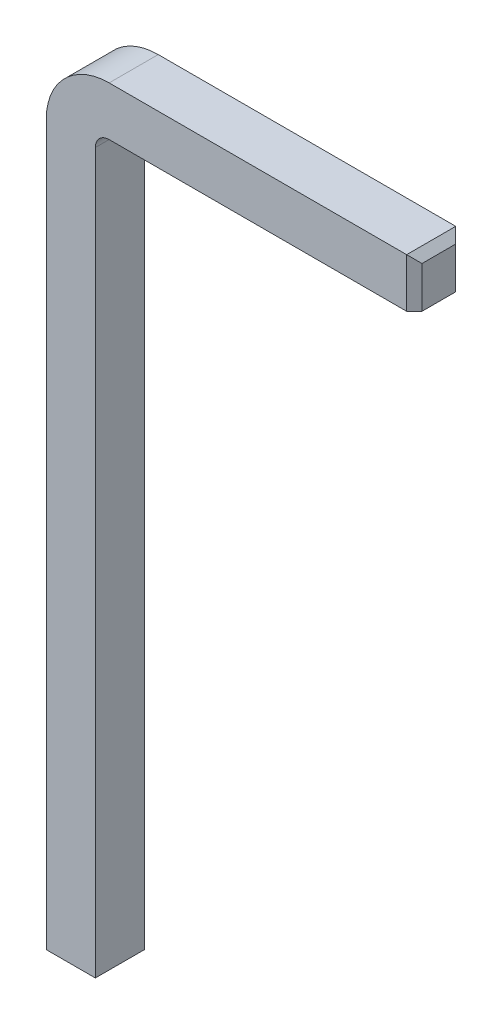
ISO-10303-21;
HEADER;
FILE_DESCRIPTION(('STEP AP214'),'2;1');
FILE_NAME('part.step','',(''),(''),'','','');
FILE_SCHEMA(('AUTOMOTIVE_DESIGN { 1 0 10303 214 1 1 1 1 }'));
ENDSEC;
DATA;
#1=APPLICATION_CONTEXT('core data for automotive mechanical design processes');
#2=APPLICATION_PROTOCOL_DEFINITION('international standard','automotive_design',2000,#1);
#3=PRODUCT_CONTEXT('',#1,'mechanical');
#4=PRODUCT('Part','Part','',(#3));
#5=PRODUCT_RELATED_PRODUCT_CATEGORY('part','',(#4));
#6=PRODUCT_DEFINITION_FORMATION('','',#4);
#7=PRODUCT_DEFINITION_CONTEXT('part definition',#1,'design');
#8=PRODUCT_DEFINITION('design','',#6,#7);
#9=PRODUCT_DEFINITION_SHAPE('','',#8);
#10=(LENGTH_UNIT() NAMED_UNIT(*) SI_UNIT(.MILLI.,.METRE.));
#11=(NAMED_UNIT(*) PLANE_ANGLE_UNIT() SI_UNIT($,.RADIAN.));
#12=(NAMED_UNIT(*) SI_UNIT($,.STERADIAN.) SOLID_ANGLE_UNIT());
#13=UNCERTAINTY_MEASURE_WITH_UNIT(LENGTH_MEASURE(1.E-05),#10,'distance_accuracy_value','');
#14=(GEOMETRIC_REPRESENTATION_CONTEXT(3) GLOBAL_UNCERTAINTY_ASSIGNED_CONTEXT((#13)) GLOBAL_UNIT_ASSIGNED_CONTEXT((#10,
#11,#12)) REPRESENTATION_CONTEXT('',''));
#15=CARTESIAN_POINT('',(0.,0.,0.));
#16=DIRECTION('',(0.,0.,1.));
#17=DIRECTION('',(1.,0.,0.));
#18=AXIS2_PLACEMENT_3D('',#15,#16,#17);
#19=CARTESIAN_POINT('',(0.500000000000009,10.3,-0.32));
#20=DIRECTION('',(0.,1.,0.));
#21=DIRECTION('',(0.,0.,1.));
#22=AXIS2_PLACEMENT_3D('',#19,#20,#21);
#23=PLANE('',#22);
#24=DIRECTION('',(1.,0.,0.));
#25=VECTOR('',#24,1.);
#26=CARTESIAN_POINT('',(0.500000000000009,10.3,0.32));
#27=LINE('',#26,#25);
#28=CARTESIAN_POINT('',(0.500000000000009,10.3,0.32));
#29=VERTEX_POINT('',#28);
#30=CARTESIAN_POINT('',(4.38000000000001,10.3,0.32));
#31=VERTEX_POINT('',#30);
#32=EDGE_CURVE('E177',#29,#31,#27,.T.);
#33=ORIENTED_EDGE('',*,*,#32,.T.);
#34=DIRECTION('',(0.,0.,-1.));
#35=VECTOR('',#34,1.);
#36=CARTESIAN_POINT('',(4.38,10.3,-0.32));
#37=LINE('',#36,#35);
#38=CARTESIAN_POINT('',(4.38,10.3,-0.32));
#39=VERTEX_POINT('',#38);
#40=EDGE_CURVE('E11',#31,#39,#37,.T.);
#41=ORIENTED_EDGE('',*,*,#40,.T.);
#42=DIRECTION('',(1.,0.,0.));
#43=VECTOR('',#42,1.);
#44=CARTESIAN_POINT('',(0.500000000000009,10.3,-0.32));
#45=LINE('',#44,#43);
#46=CARTESIAN_POINT('',(0.500000000000009,10.3,-0.32));
#47=VERTEX_POINT('',#46);
#48=EDGE_CURVE('E180',#47,#39,#45,.T.);
#49=ORIENTED_EDGE('',*,*,#48,.F.);
#50=DIRECTION('',(0.,0.,1.));
#51=VECTOR('',#50,1.);
#52=CARTESIAN_POINT('',(0.500000000000009,10.3,-0.32));
#53=LINE('',#52,#51);
#54=EDGE_CURVE('E157',#47,#29,#53,.T.);
#55=ORIENTED_EDGE('',*,*,#54,.T.);
#56=EDGE_LOOP('',(#33,#41,#49,#55));
#57=FACE_BOUND('',#56,.T.);
#58=ADVANCED_FACE('F33',(#57),#23,.T.);
#59=CARTESIAN_POINT('',(0.499999999999999,9.66,-0.32));
#60=DIRECTION('',(0.,-1.,0.));
#61=DIRECTION('',(0.,0.,-1.));
#62=AXIS2_PLACEMENT_3D('',#59,#60,#61);
#63=PLANE('',#62);
#64=DIRECTION('',(1.,0.,0.));
#65=VECTOR('',#64,1.);
#66=CARTESIAN_POINT('',(0.499999999999999,9.66,-0.32));
#67=LINE('',#66,#65);
#68=CARTESIAN_POINT('',(0.499999999999999,9.66,-0.32));
#69=VERTEX_POINT('',#68);
#70=CARTESIAN_POINT('',(4.38,9.66,-0.32));
#71=VERTEX_POINT('',#70);
#72=EDGE_CURVE('E133',#69,#71,#67,.T.);
#73=ORIENTED_EDGE('',*,*,#72,.T.);
#74=DIRECTION('',(0.707106781186547,0.,0.707106781186548));
#75=VECTOR('',#74,1.);
#76=CARTESIAN_POINT('',(2.44,9.66,-2.26));
#77=LINE('',#76,#75);
#78=CARTESIAN_POINT('',(4.48,9.66,-0.22));
#79=VERTEX_POINT('',#78);
#80=EDGE_CURVE('E42',#71,#79,#77,.T.);
#81=ORIENTED_EDGE('',*,*,#80,.T.);
#82=DIRECTION('',(0.,0.,-1.));
#83=VECTOR('',#82,1.);
#84=CARTESIAN_POINT('',(4.48,9.66,-0.32));
#85=LINE('',#84,#83);
#86=CARTESIAN_POINT('',(4.48,9.66,0.22));
#87=VERTEX_POINT('',#86);
#88=EDGE_CURVE('E137',#87,#79,#85,.T.);
#89=ORIENTED_EDGE('',*,*,#88,.F.);
#90=DIRECTION('',(-0.707106781186547,0.,0.707106781186548));
#91=VECTOR('',#90,1.);
#92=CARTESIAN_POINT('',(2.76,9.66,1.94));
#93=LINE('',#92,#91);
#94=CARTESIAN_POINT('',(4.38,9.66,0.32));
#95=VERTEX_POINT('',#94);
#96=EDGE_CURVE('E209',#87,#95,#93,.T.);
#97=ORIENTED_EDGE('',*,*,#96,.T.);
#98=DIRECTION('',(1.,0.,0.));
#99=VECTOR('',#98,1.);
#100=CARTESIAN_POINT('',(0.499999999999999,9.66,0.32));
#101=LINE('',#100,#99);
#102=CARTESIAN_POINT('',(0.499999999999999,9.66,0.32));
#103=VERTEX_POINT('',#102);
#104=EDGE_CURVE('E174',#103,#95,#101,.T.);
#105=ORIENTED_EDGE('',*,*,#104,.F.);
#106=DIRECTION('',(0.,0.,-1.));
#107=VECTOR('',#106,1.);
#108=CARTESIAN_POINT('',(0.499999999999999,9.66,-0.32));
#109=LINE('',#108,#107);
#110=EDGE_CURVE('E154',#103,#69,#109,.T.);
#111=ORIENTED_EDGE('',*,*,#110,.T.);
#112=EDGE_LOOP('',(#73,#81,#89,#97,#105,#111));
#113=FACE_BOUND('',#112,.T.);
#114=ADVANCED_FACE('F231',(#113),#63,.T.);
#115=CARTESIAN_POINT('',(0.5,9.48,0.));
#116=DIRECTION('',(0.,0.,-1.));
#117=DIRECTION('',(-1.,0.,0.));
#118=AXIS2_PLACEMENT_3D('',#115,#116,#117);
#119=CYLINDRICAL_SURFACE('',#118,0.819999999999999);
#120=DIRECTION('',(0.,0.,1.));
#121=VECTOR('',#120,1.);
#122=CARTESIAN_POINT('',(-0.319999999999999,9.48,-0.32));
#123=LINE('',#122,#121);
#124=CARTESIAN_POINT('',(-0.319999999999999,9.48,-0.32));
#125=VERTEX_POINT('',#124);
#126=CARTESIAN_POINT('',(-0.319999999999999,9.48,0.32));
#127=VERTEX_POINT('',#126);
#128=EDGE_CURVE('E148',#125,#127,#123,.T.);
#129=ORIENTED_EDGE('',*,*,#128,.T.);
#130=CARTESIAN_POINT('',(0.5,9.48,0.32));
#131=DIRECTION('',(0.,0.,-1.));
#132=DIRECTION('',(-1.,0.,0.));
#133=AXIS2_PLACEMENT_3D('',#130,#131,#132);
#134=CIRCLE('',#133,0.819999999999999);
#135=EDGE_CURVE('E167',#127,#29,#134,.T.);
#136=ORIENTED_EDGE('',*,*,#135,.T.);
#137=ORIENTED_EDGE('',*,*,#54,.F.);
#138=CARTESIAN_POINT('',(0.5,9.48,-0.32));
#139=DIRECTION('',(0.,0.,-1.));
#140=DIRECTION('',(-1.,0.,0.));
#141=AXIS2_PLACEMENT_3D('',#138,#139,#140);
#142=CIRCLE('',#141,0.819999999999999);
#143=EDGE_CURVE('E138',#125,#47,#142,.T.);
#144=ORIENTED_EDGE('',*,*,#143,.F.);
#145=EDGE_LOOP('',(#129,#136,#137,#144));
#146=FACE_BOUND('',#145,.T.);
#147=ADVANCED_FACE('F239',(#146),#119,.T.);
#148=CARTESIAN_POINT('',(0.5,9.48,0.));
#149=DIRECTION('',(0.,0.,-1.));
#150=DIRECTION('',(-1.,0.,0.));
#151=AXIS2_PLACEMENT_3D('',#148,#149,#150);
#152=CYLINDRICAL_SURFACE('',#151,0.179999999999999);
#153=DIRECTION('',(0.,0.,-1.));
#154=VECTOR('',#153,1.);
#155=CARTESIAN_POINT('',(0.320000000000001,9.48,-0.32));
#156=LINE('',#155,#154);
#157=CARTESIAN_POINT('',(0.320000000000001,9.48,0.32));
#158=VERTEX_POINT('',#157);
#159=CARTESIAN_POINT('',(0.320000000000001,9.48,-0.32));
#160=VERTEX_POINT('',#159);
#161=EDGE_CURVE('E141',#158,#160,#156,.T.);
#162=ORIENTED_EDGE('',*,*,#161,.T.);
#163=CARTESIAN_POINT('',(0.5,9.48,-0.32));
#164=DIRECTION('',(0.,0.,-1.));
#165=DIRECTION('',(-1.,0.,0.));
#166=AXIS2_PLACEMENT_3D('',#163,#164,#165);
#167=CIRCLE('',#166,0.179999999999999);
#168=EDGE_CURVE('E125',#160,#69,#167,.T.);
#169=ORIENTED_EDGE('',*,*,#168,.T.);
#170=ORIENTED_EDGE('',*,*,#110,.F.);
#171=CARTESIAN_POINT('',(0.5,9.48,0.32));
#172=DIRECTION('',(0.,0.,-1.));
#173=DIRECTION('',(-1.,0.,0.));
#174=AXIS2_PLACEMENT_3D('',#171,#172,#173);
#175=CIRCLE('',#174,0.179999999999999);
#176=EDGE_CURVE('E144',#158,#103,#175,.T.);
#177=ORIENTED_EDGE('',*,*,#176,.F.);
#178=EDGE_LOOP('',(#162,#169,#170,#177));
#179=FACE_BOUND('',#178,.T.);
#180=ADVANCED_FACE('F142',(#179),#152,.F.);
#181=CARTESIAN_POINT('',(0.320000000000001,9.48,-0.32));
#182=DIRECTION('',(-1.,0.,0.));
#183=DIRECTION('',(0.,0.,1.));
#184=AXIS2_PLACEMENT_3D('',#181,#182,#183);
#185=PLANE('',#184);
#186=DIRECTION('',(0.,-1.,0.));
#187=VECTOR('',#186,1.);
#188=CARTESIAN_POINT('',(0.320000000000001,9.48,0.32));
#189=LINE('',#188,#187);
#190=CARTESIAN_POINT('',(0.320000000000001,0.0999999999999994,0.32));
#191=VERTEX_POINT('',#190);
#192=EDGE_CURVE('E246',#158,#191,#189,.T.);
#193=ORIENTED_EDGE('',*,*,#192,.T.);
#194=DIRECTION('',(0.,0.,-1.));
#195=VECTOR('',#194,1.);
#196=CARTESIAN_POINT('',(0.320000000000001,0.0999999999999994,-0.32));
#197=LINE('',#196,#195);
#198=CARTESIAN_POINT('',(0.320000000000001,0.0999999999999994,-0.32));
#199=VERTEX_POINT('',#198);
#200=EDGE_CURVE('E153',#191,#199,#197,.T.);
#201=ORIENTED_EDGE('',*,*,#200,.T.);
#202=DIRECTION('',(0.,-1.,0.));
#203=VECTOR('',#202,1.);
#204=CARTESIAN_POINT('',(0.320000000000001,9.48,-0.32));
#205=LINE('',#204,#203);
#206=EDGE_CURVE('E130',#160,#199,#205,.T.);
#207=ORIENTED_EDGE('',*,*,#206,.F.);
#208=ORIENTED_EDGE('',*,*,#161,.F.);
#209=EDGE_LOOP('',(#193,#201,#207,#208));
#210=FACE_BOUND('',#209,.T.);
#211=ADVANCED_FACE('F151',(#210),#185,.F.);
#212=CARTESIAN_POINT('',(-0.319999999999999,9.48,-0.32));
#213=DIRECTION('',(0.,0.,1.));
#214=DIRECTION('',(1.,0.,0.));
#215=AXIS2_PLACEMENT_3D('',#212,#213,#214);
#216=PLANE('',#215);
#217=ORIENTED_EDGE('',*,*,#206,.T.);
#218=DIRECTION('',(-1.,0.,0.));
#219=VECTOR('',#218,1.);
#220=CARTESIAN_POINT('',(-0.319999999999999,0.0999999999999994,-0.32));
#221=LINE('',#220,#219);
#222=CARTESIAN_POINT('',(-0.319999999999999,0.0999999999999994,-0.32));
#223=VERTEX_POINT('',#222);
#224=EDGE_CURVE('E186',#199,#223,#221,.T.);
#225=ORIENTED_EDGE('',*,*,#224,.T.);
#226=DIRECTION('',(0.,-1.,0.));
#227=VECTOR('',#226,1.);
#228=CARTESIAN_POINT('',(-0.319999999999999,9.48,-0.32));
#229=LINE('',#228,#227);
#230=EDGE_CURVE('E155',#125,#223,#229,.T.);
#231=ORIENTED_EDGE('',*,*,#230,.F.);
#232=ORIENTED_EDGE('',*,*,#143,.T.);
#233=ORIENTED_EDGE('',*,*,#48,.T.);
#234=DIRECTION('',(0.,-1.,0.));
#235=VECTOR('',#234,1.);
#236=CARTESIAN_POINT('',(4.38,9.66,-0.32));
#237=LINE('',#236,#235);
#238=EDGE_CURVE('E184',#39,#71,#237,.T.);
#239=ORIENTED_EDGE('',*,*,#238,.T.);
#240=ORIENTED_EDGE('',*,*,#72,.F.);
#241=ORIENTED_EDGE('',*,*,#168,.F.);
#242=EDGE_LOOP('',(#217,#225,#231,#232,#233,#239,#240,#241));
#243=FACE_BOUND('',#242,.T.);
#244=ADVANCED_FACE('F127',(#243),#216,.F.);
#245=CARTESIAN_POINT('',(-0.319999999999999,9.48,-0.32));
#246=DIRECTION('',(1.,0.,0.));
#247=DIRECTION('',(0.,0.,-1.));
#248=AXIS2_PLACEMENT_3D('',#245,#246,#247);
#249=PLANE('',#248);
#250=ORIENTED_EDGE('',*,*,#230,.T.);
#251=DIRECTION('',(0.,0.,1.));
#252=VECTOR('',#251,1.);
#253=CARTESIAN_POINT('',(-0.319999999999999,0.0999999999999994,-0.32));
#254=LINE('',#253,#252);
#255=CARTESIAN_POINT('',(-0.319999999999999,0.0999999999999994,0.32));
#256=VERTEX_POINT('',#255);
#257=EDGE_CURVE('E197',#223,#256,#254,.T.);
#258=ORIENTED_EDGE('',*,*,#257,.T.);
#259=DIRECTION('',(0.,-1.,0.));
#260=VECTOR('',#259,1.);
#261=CARTESIAN_POINT('',(-0.319999999999999,9.48,0.32));
#262=LINE('',#261,#260);
#263=EDGE_CURVE('E160',#127,#256,#262,.T.);
#264=ORIENTED_EDGE('',*,*,#263,.F.);
#265=ORIENTED_EDGE('',*,*,#128,.F.);
#266=EDGE_LOOP('',(#250,#258,#264,#265));
#267=FACE_BOUND('',#266,.T.);
#268=ADVANCED_FACE('F264',(#267),#249,.F.);
#269=CARTESIAN_POINT('',(-0.319999999999999,9.48,0.32));
#270=DIRECTION('',(0.,0.,-1.));
#271=DIRECTION('',(-1.,0.,0.));
#272=AXIS2_PLACEMENT_3D('',#269,#270,#271);
#273=PLANE('',#272);
#274=ORIENTED_EDGE('',*,*,#263,.T.);
#275=DIRECTION('',(1.,0.,0.));
#276=VECTOR('',#275,1.);
#277=CARTESIAN_POINT('',(-0.319999999999999,0.0999999999999994,0.32));
#278=LINE('',#277,#276);
#279=EDGE_CURVE('E201',#256,#191,#278,.T.);
#280=ORIENTED_EDGE('',*,*,#279,.T.);
#281=ORIENTED_EDGE('',*,*,#192,.F.);
#282=ORIENTED_EDGE('',*,*,#176,.T.);
#283=ORIENTED_EDGE('',*,*,#104,.T.);
#284=DIRECTION('',(0.,1.,0.));
#285=VECTOR('',#284,1.);
#286=CARTESIAN_POINT('',(4.38000000000001,10.3,0.32));
#287=LINE('',#286,#285);
#288=EDGE_CURVE('E199',#95,#31,#287,.T.);
#289=ORIENTED_EDGE('',*,*,#288,.T.);
#290=ORIENTED_EDGE('',*,*,#32,.F.);
#291=ORIENTED_EDGE('',*,*,#135,.F.);
#292=EDGE_LOOP('',(#274,#280,#281,#282,#283,#289,#290,#291));
#293=FACE_BOUND('',#292,.T.);
#294=ADVANCED_FACE('F244',(#293),#273,.F.);
#295=CARTESIAN_POINT('',(4.48,9.98,0.));
#296=DIRECTION('',(1.,0.,0.));
#297=DIRECTION('',(0.,0.,1.));
#298=AXIS2_PLACEMENT_3D('',#295,#296,#297);
#299=PLANE('',#298);
#300=ORIENTED_EDGE('',*,*,#88,.T.);
#301=DIRECTION('',(0.,1.,0.));
#302=VECTOR('',#301,1.);
#303=CARTESIAN_POINT('',(4.48,10.3,-0.220000000000001));
#304=LINE('',#303,#302);
#305=CARTESIAN_POINT('',(4.48,10.2,-0.220000000000001));
#306=VERTEX_POINT('',#305);
#307=EDGE_CURVE('E207',#79,#306,#304,.T.);
#308=ORIENTED_EDGE('',*,*,#307,.T.);
#309=DIRECTION('',(0.,0.,1.));
#310=VECTOR('',#309,1.);
#311=CARTESIAN_POINT('',(4.48,10.2,0.));
#312=LINE('',#311,#310);
#313=CARTESIAN_POINT('',(4.48,10.2,0.220000000000001));
#314=VERTEX_POINT('',#313);
#315=EDGE_CURVE('E57',#306,#314,#312,.T.);
#316=ORIENTED_EDGE('',*,*,#315,.T.);
#317=DIRECTION('',(0.,-1.,0.));
#318=VECTOR('',#317,1.);
#319=CARTESIAN_POINT('',(4.48,9.66,0.220000000000001));
#320=LINE('',#319,#318);
#321=EDGE_CURVE('E204',#314,#87,#320,.T.);
#322=ORIENTED_EDGE('',*,*,#321,.T.);
#323=EDGE_LOOP('',(#300,#308,#316,#322));
#324=FACE_BOUND('',#323,.T.);
#325=ADVANCED_FACE('F229',(#324),#299,.T.);
#326=CARTESIAN_POINT('',(0.,0.,0.));
#327=DIRECTION('',(0.,1.,0.));
#328=DIRECTION('',(0.,0.,1.));
#329=AXIS2_PLACEMENT_3D('',#326,#327,#328);
#330=PLANE('',#329);
#331=DIRECTION('',(0.,0.,-1.));
#332=VECTOR('',#331,1.);
#333=CARTESIAN_POINT('',(-0.22,0.,0.));
#334=LINE('',#333,#332);
#335=CARTESIAN_POINT('',(-0.22,0.,0.220000000000001));
#336=VERTEX_POINT('',#335);
#337=CARTESIAN_POINT('',(-0.22,0.,-0.220000000000001));
#338=VERTEX_POINT('',#337);
#339=EDGE_CURVE('E192',#336,#338,#334,.T.);
#340=ORIENTED_EDGE('',*,*,#339,.T.);
#341=DIRECTION('',(1.,0.,0.));
#342=VECTOR('',#341,1.);
#343=CARTESIAN_POINT('',(0.,0.,-0.220000000000001));
#344=LINE('',#343,#342);
#345=CARTESIAN_POINT('',(0.220000000000001,0.,-0.220000000000001));
#346=VERTEX_POINT('',#345);
#347=EDGE_CURVE('E194',#338,#346,#344,.T.);
#348=ORIENTED_EDGE('',*,*,#347,.T.);
#349=DIRECTION('',(0.,0.,1.));
#350=VECTOR('',#349,1.);
#351=CARTESIAN_POINT('',(0.220000000000001,0.,0.));
#352=LINE('',#351,#350);
#353=CARTESIAN_POINT('',(0.220000000000001,0.,0.220000000000001));
#354=VERTEX_POINT('',#353);
#355=EDGE_CURVE('E188',#346,#354,#352,.T.);
#356=ORIENTED_EDGE('',*,*,#355,.T.);
#357=DIRECTION('',(-1.,0.,0.));
#358=VECTOR('',#357,1.);
#359=CARTESIAN_POINT('',(0.,0.,0.220000000000001));
#360=LINE('',#359,#358);
#361=EDGE_CURVE('E190',#354,#336,#360,.T.);
#362=ORIENTED_EDGE('',*,*,#361,.T.);
#363=EDGE_LOOP('',(#340,#348,#356,#362));
#364=FACE_BOUND('',#363,.T.);
#365=ADVANCED_FACE('F269',(#364),#330,.F.);
#366=CARTESIAN_POINT('',(-0.319999999999999,0.0999999999999994,0.32));
#367=DIRECTION('',(0.,0.707106781186548,-0.707106781186548));
#368=DIRECTION('',(1.,0.,0.));
#369=AXIS2_PLACEMENT_3D('',#366,#367,#368);
#370=PLANE('',#369);
#371=DIRECTION('',(0.577350269189626,-0.577350269189626,-0.577350269189626));
#372=VECTOR('',#371,1.);
#373=CARTESIAN_POINT('',(-0.319999999999999,0.0999999999999994,0.32));
#374=LINE('',#373,#372);
#375=EDGE_CURVE('E216',#336,#256,#374,.F.);
#376=ORIENTED_EDGE('',*,*,#375,.F.);
#377=ORIENTED_EDGE('',*,*,#361,.F.);
#378=DIRECTION('',(-0.577350269189626,-0.577350269189626,-0.577350269189626));
#379=VECTOR('',#378,1.);
#380=CARTESIAN_POINT('',(0.106666666666668,-0.113333333333334,0.106666666666667));
#381=LINE('',#380,#379);
#382=EDGE_CURVE('E149',#191,#354,#381,.T.);
#383=ORIENTED_EDGE('',*,*,#382,.F.);
#384=ORIENTED_EDGE('',*,*,#279,.F.);
#385=EDGE_LOOP('',(#376,#377,#383,#384));
#386=FACE_BOUND('',#385,.T.);
#387=ADVANCED_FACE('F253',(#386),#370,.F.);
#388=CARTESIAN_POINT('',(0.320000000000001,0.0999999999999994,-0.32));
#389=DIRECTION('',(-0.707106781186548,0.707106781186548,0.));
#390=DIRECTION('',(0.,0.,-1.));
#391=AXIS2_PLACEMENT_3D('',#388,#389,#390);
#392=PLANE('',#391);
#393=ORIENTED_EDGE('',*,*,#382,.T.);
#394=ORIENTED_EDGE('',*,*,#355,.F.);
#395=DIRECTION('',(0.577350269189626,0.577350269189626,-0.577350269189626));
#396=VECTOR('',#395,1.);
#397=CARTESIAN_POINT('',(0.320000000000001,0.0999999999999994,-0.32));
#398=LINE('',#397,#396);
#399=EDGE_CURVE('E214',#199,#346,#398,.F.);
#400=ORIENTED_EDGE('',*,*,#399,.F.);
#401=ORIENTED_EDGE('',*,*,#200,.F.);
#402=EDGE_LOOP('',(#393,#394,#400,#401));
#403=FACE_BOUND('',#402,.T.);
#404=ADVANCED_FACE('F256',(#403),#392,.F.);
#405=CARTESIAN_POINT('',(-0.319999999999999,0.0999999999999994,-0.32));
#406=DIRECTION('',(0.707106781186548,0.707106781186548,0.));
#407=DIRECTION('',(0.,0.,1.));
#408=AXIS2_PLACEMENT_3D('',#405,#406,#407);
#409=PLANE('',#408);
#410=ORIENTED_EDGE('',*,*,#375,.T.);
#411=ORIENTED_EDGE('',*,*,#257,.F.);
#412=DIRECTION('',(0.577350269189626,-0.577350269189626,0.577350269189626));
#413=VECTOR('',#412,1.);
#414=CARTESIAN_POINT('',(-0.319999999999999,0.0999999999999994,-0.32));
#415=LINE('',#414,#413);
#416=EDGE_CURVE('E212',#338,#223,#415,.F.);
#417=ORIENTED_EDGE('',*,*,#416,.F.);
#418=ORIENTED_EDGE('',*,*,#339,.F.);
#419=EDGE_LOOP('',(#410,#411,#417,#418));
#420=FACE_BOUND('',#419,.T.);
#421=ADVANCED_FACE('F266',(#420),#409,.F.);
#422=CARTESIAN_POINT('',(-0.319999999999999,0.0999999999999994,-0.32));
#423=DIRECTION('',(0.,0.707106781186548,0.707106781186548));
#424=DIRECTION('',(-1.,0.,0.));
#425=AXIS2_PLACEMENT_3D('',#422,#423,#424);
#426=PLANE('',#425);
#427=ORIENTED_EDGE('',*,*,#399,.T.);
#428=ORIENTED_EDGE('',*,*,#347,.F.);
#429=ORIENTED_EDGE('',*,*,#416,.T.);
#430=ORIENTED_EDGE('',*,*,#224,.F.);
#431=EDGE_LOOP('',(#427,#428,#429,#430));
#432=FACE_BOUND('',#431,.T.);
#433=ADVANCED_FACE('F260',(#432),#426,.F.);
#434=CARTESIAN_POINT('',(4.48,9.98,0.220000000000001));
#435=DIRECTION('',(0.707106781186548,0.,0.707106781186547));
#436=DIRECTION('',(0.,1.,0.));
#437=AXIS2_PLACEMENT_3D('',#434,#435,#436);
#438=PLANE('',#437);
#439=ORIENTED_EDGE('',*,*,#96,.F.);
#440=ORIENTED_EDGE('',*,*,#321,.F.);
#441=DIRECTION('',(0.57735026918962,-0.57735026918963,-0.577350269189628));
#442=VECTOR('',#441,1.);
#443=CARTESIAN_POINT('',(4.55333333333334,10.1266666666667,0.146666666666668));
#444=LINE('',#443,#442);
#445=EDGE_CURVE('E37',#31,#314,#444,.T.);
#446=ORIENTED_EDGE('',*,*,#445,.F.);
#447=ORIENTED_EDGE('',*,*,#288,.F.);
#448=EDGE_LOOP('',(#439,#440,#446,#447));
#449=FACE_BOUND('',#448,.T.);
#450=ADVANCED_FACE('F35',(#449),#438,.T.);
#451=CARTESIAN_POINT('',(4.48,10.2,0.));
#452=DIRECTION('',(-0.707106781186554,-0.707106781186541,0.));
#453=DIRECTION('',(0.,0.,1.));
#454=AXIS2_PLACEMENT_3D('',#451,#452,#453);
#455=PLANE('',#454);
#456=ORIENTED_EDGE('',*,*,#445,.T.);
#457=ORIENTED_EDGE('',*,*,#315,.F.);
#458=DIRECTION('',(0.57735026918962,-0.57735026918963,0.577350269189628));
#459=VECTOR('',#458,1.);
#460=CARTESIAN_POINT('',(4.55333333333334,10.1266666666667,-0.146666666666666));
#461=LINE('',#460,#459);
#462=EDGE_CURVE('E50',#39,#306,#461,.T.);
#463=ORIENTED_EDGE('',*,*,#462,.F.);
#464=ORIENTED_EDGE('',*,*,#40,.F.);
#465=EDGE_LOOP('',(#456,#457,#463,#464));
#466=FACE_BOUND('',#465,.T.);
#467=ADVANCED_FACE('F224',(#466),#455,.F.);
#468=CARTESIAN_POINT('',(4.48,9.98,-0.220000000000001));
#469=DIRECTION('',(0.707106781186548,0.,-0.707106781186547));
#470=DIRECTION('',(0.,-1.,0.));
#471=AXIS2_PLACEMENT_3D('',#468,#469,#470);
#472=PLANE('',#471);
#473=ORIENTED_EDGE('',*,*,#80,.F.);
#474=ORIENTED_EDGE('',*,*,#238,.F.);
#475=ORIENTED_EDGE('',*,*,#462,.T.);
#476=ORIENTED_EDGE('',*,*,#307,.F.);
#477=EDGE_LOOP('',(#473,#474,#475,#476));
#478=FACE_BOUND('',#477,.T.);
#479=ADVANCED_FACE('F233',(#478),#472,.T.);
#480=CLOSED_SHELL('',(#58,#114,#147,#180,#211,#244,#268,#294,#325,#365,#387,#404,#421,#433,#450,
#467,#479));
#481=MANIFOLD_SOLID_BREP('B2',#480);
#482=ADVANCED_BREP_SHAPE_REPRESENTATION('',(#18,#481),#14);
#483=SHAPE_DEFINITION_REPRESENTATION(#9,#482);
ENDSEC;
END-ISO-10303-21;
